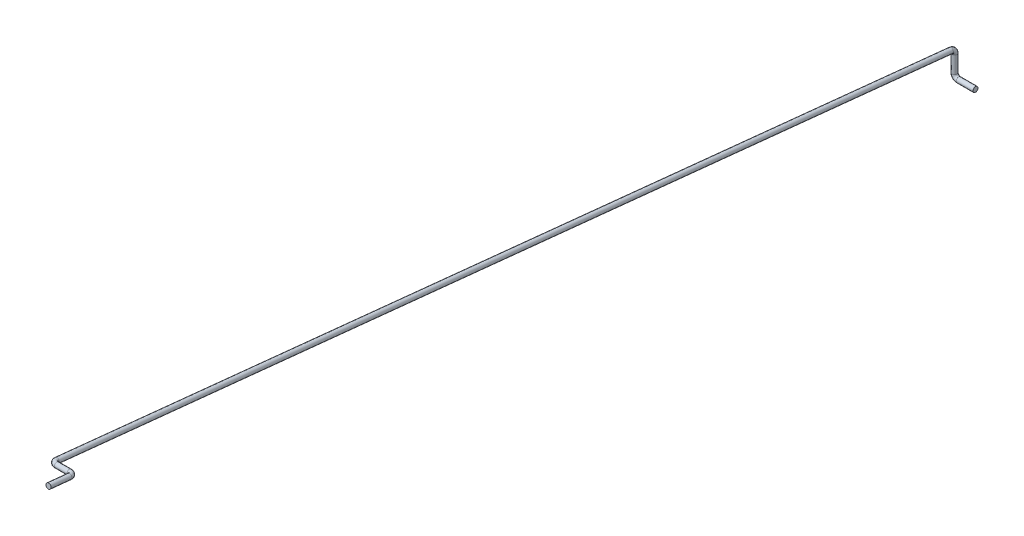
ISO-10303-21;
HEADER;
FILE_DESCRIPTION(('STEP AP214'),'2;1');
FILE_NAME('part.step','',(''),(''),'','','');
FILE_SCHEMA(('AUTOMOTIVE_DESIGN { 1 0 10303 214 1 1 1 1 }'));
ENDSEC;
DATA;
#1=APPLICATION_CONTEXT('core data for automotive mechanical design processes');
#2=APPLICATION_PROTOCOL_DEFINITION('international standard','automotive_design',2000,#1);
#3=PRODUCT_CONTEXT('',#1,'mechanical');
#4=PRODUCT('Part','Part','',(#3));
#5=PRODUCT_RELATED_PRODUCT_CATEGORY('part','',(#4));
#6=PRODUCT_DEFINITION_FORMATION('','',#4);
#7=PRODUCT_DEFINITION_CONTEXT('part definition',#1,'design');
#8=PRODUCT_DEFINITION('design','',#6,#7);
#9=PRODUCT_DEFINITION_SHAPE('','',#8);
#10=(LENGTH_UNIT() NAMED_UNIT(*) SI_UNIT(.MILLI.,.METRE.));
#11=(NAMED_UNIT(*) PLANE_ANGLE_UNIT() SI_UNIT($,.RADIAN.));
#12=(NAMED_UNIT(*) SI_UNIT($,.STERADIAN.) SOLID_ANGLE_UNIT());
#13=UNCERTAINTY_MEASURE_WITH_UNIT(LENGTH_MEASURE(1.E-05),#10,'distance_accuracy_value','');
#14=(GEOMETRIC_REPRESENTATION_CONTEXT(3) GLOBAL_UNCERTAINTY_ASSIGNED_CONTEXT((#13)) GLOBAL_UNIT_ASSIGNED_CONTEXT((#10,
#11,#12)) REPRESENTATION_CONTEXT('',''));
#15=CARTESIAN_POINT('',(0.,0.,0.));
#16=DIRECTION('',(0.,0.,1.));
#17=DIRECTION('',(1.,0.,0.));
#18=AXIS2_PLACEMENT_3D('',#15,#16,#17);
#19=CARTESIAN_POINT('',(0.,2.99475970675467,0.897759470769358));
#20=DIRECTION('',(0.,0.102240529230642,0.994759706754671));
#21=DIRECTION('',(0.,-0.994759706754671,0.102240529230642));
#22=AXIS2_PLACEMENT_3D('',#19,#20,#21);
#23=CYLINDRICAL_SURFACE('',#22,0.6);
#24=CARTESIAN_POINT('',(0.,2.99475970675467,0.897759470769358));
#25=DIRECTION('',(0.,0.102240529230644,0.99475970675467));
#26=DIRECTION('',(0.,-0.99475970675467,0.102240529230644));
#27=AXIS2_PLACEMENT_3D('',#24,#25,#26);
#28=CIRCLE('',#27,0.6);
#29=CARTESIAN_POINT('',(0.,3.59161553080747,0.836415153230973));
#30=VERTEX_POINT('',#29);
#31=EDGE_CURVE('E35',#30,#30,#28,.T.);
#32=ORIENTED_EDGE('',*,*,#31,.T.);
#33=EDGE_LOOP('',(#32));
#34=FACE_BOUND('',#33,.T.);
#35=CARTESIAN_POINT('',(0.,24.8977594707693,214.005240293245));
#36=DIRECTION('',(0.,0.102240529230644,0.99475970675467));
#37=DIRECTION('',(0.,-0.99475970675467,0.102240529230644));
#38=AXIS2_PLACEMENT_3D('',#35,#36,#37);
#39=CIRCLE('',#38,0.6);
#40=CARTESIAN_POINT('',(-0.599999999999984,24.8977594707693,214.005240293245));
#41=VERTEX_POINT('',#40);
#42=EDGE_CURVE('E10',#41,#41,#39,.T.);
#43=ORIENTED_EDGE('',*,*,#42,.F.);
#44=EDGE_LOOP('',(#43));
#45=FACE_BOUND('',#44,.T.);
#46=ADVANCED_FACE('F29',(#34,#45),#23,.T.);
#47=CARTESIAN_POINT('',(0.,2.,1.));
#48=DIRECTION('',(1.,0.,0.));
#49=DIRECTION('',(0.,0.,-1.));
#50=AXIS2_PLACEMENT_3D('',#47,#48,#49);
#51=TOROIDAL_SURFACE('',#50,1.,0.6);
#52=CARTESIAN_POINT('',(0.,2.,0.));
#53=DIRECTION('',(0.,1.,0.));
#54=DIRECTION('',(0.,0.,1.));
#55=AXIS2_PLACEMENT_3D('',#52,#53,#54);
#56=CIRCLE('',#55,0.6);
#57=CARTESIAN_POINT('',(0.,2.,-0.6));
#58=VERTEX_POINT('',#57);
#59=EDGE_CURVE('E39',#58,#58,#56,.T.);
#60=CARTESIAN_POINT('',(0.,2.,1.));
#61=DIRECTION('',(1.,0.,0.));
#62=DIRECTION('',(0.,0.,-1.));
#63=AXIS2_PLACEMENT_3D('',#60,#61,#62);
#64=CIRCLE('',#63,1.6);
#65=EDGE_CURVE('',#58,#30,#64,.T.);
#66=ORIENTED_EDGE('',*,*,#59,.T.);
#67=ORIENTED_EDGE('',*,*,#31,.F.);
#68=ORIENTED_EDGE('',*,*,#65,.T.);
#69=ORIENTED_EDGE('',*,*,#65,.F.);
#70=EDGE_LOOP('',(#66,#68,#67,#69));
#71=FACE_BOUND('',#70,.T.);
#72=ADVANCED_FACE('F83',(#71),#51,.T.);
#73=CARTESIAN_POINT('',(0.,2.,0.));
#74=DIRECTION('',(0.,-1.,0.));
#75=DIRECTION('',(0.,0.,-1.));
#76=AXIS2_PLACEMENT_3D('',#73,#74,#75);
#77=CYLINDRICAL_SURFACE('',#76,0.6);
#78=ORIENTED_EDGE('',*,*,#59,.F.);
#79=EDGE_LOOP('',(#78));
#80=FACE_BOUND('',#79,.T.);
#81=CARTESIAN_POINT('',(0.,-2.,0.));
#82=DIRECTION('',(0.,-1.,0.));
#83=DIRECTION('',(0.,0.,-1.));
#84=AXIS2_PLACEMENT_3D('',#81,#82,#83);
#85=CIRCLE('',#84,0.6);
#86=CARTESIAN_POINT('',(-0.6,-2.,0.));
#87=VERTEX_POINT('',#86);
#88=EDGE_CURVE('E51',#87,#87,#85,.T.);
#89=ORIENTED_EDGE('',*,*,#88,.F.);
#90=EDGE_LOOP('',(#89));
#91=FACE_BOUND('',#90,.T.);
#92=ADVANCED_FACE('F87',(#80,#91),#77,.T.);
#93=CARTESIAN_POINT('',(1.,-3.,0.));
#94=DIRECTION('',(1.,0.,0.));
#95=DIRECTION('',(0.,0.,-1.));
#96=AXIS2_PLACEMENT_3D('',#93,#94,#95);
#97=CYLINDRICAL_SURFACE('',#96,0.6);
#98=CARTESIAN_POINT('',(1.,-3.,0.));
#99=DIRECTION('',(1.,0.,0.));
#100=DIRECTION('',(0.,0.,-1.));
#101=AXIS2_PLACEMENT_3D('',#98,#99,#100);
#102=CIRCLE('',#101,0.6);
#103=CARTESIAN_POINT('',(1.,-3.6,0.));
#104=VERTEX_POINT('',#103);
#105=EDGE_CURVE('E48',#104,#104,#102,.T.);
#106=ORIENTED_EDGE('',*,*,#105,.T.);
#107=EDGE_LOOP('',(#106));
#108=FACE_BOUND('',#107,.T.);
#109=CARTESIAN_POINT('',(5.,-3.,0.));
#110=DIRECTION('',(1.,0.,0.));
#111=DIRECTION('',(0.,0.,-1.));
#112=AXIS2_PLACEMENT_3D('',#109,#110,#111);
#113=CIRCLE('',#112,0.6);
#114=CARTESIAN_POINT('',(5.,-3.,-0.6));
#115=VERTEX_POINT('',#114);
#116=EDGE_CURVE('E43',#115,#115,#113,.T.);
#117=ORIENTED_EDGE('',*,*,#116,.F.);
#118=EDGE_LOOP('',(#117));
#119=FACE_BOUND('',#118,.T.);
#120=ADVANCED_FACE('F93',(#108,#119),#97,.T.);
#121=CARTESIAN_POINT('',(1.,-2.,0.));
#122=DIRECTION('',(0.,0.,1.));
#123=DIRECTION('',(1.,0.,0.));
#124=AXIS2_PLACEMENT_3D('',#121,#122,#123);
#125=TOROIDAL_SURFACE('',#124,1.,0.6);
#126=CARTESIAN_POINT('',(1.,-2.,0.));
#127=DIRECTION('',(0.,0.,1.));
#128=DIRECTION('',(1.,0.,0.));
#129=AXIS2_PLACEMENT_3D('',#126,#127,#128);
#130=CIRCLE('',#129,1.6);
#131=EDGE_CURVE('',#87,#104,#130,.T.);
#132=ORIENTED_EDGE('',*,*,#88,.T.);
#133=ORIENTED_EDGE('',*,*,#105,.F.);
#134=ORIENTED_EDGE('',*,*,#131,.T.);
#135=ORIENTED_EDGE('',*,*,#131,.F.);
#136=EDGE_LOOP('',(#132,#134,#133,#135));
#137=FACE_BOUND('',#136,.T.);
#138=ADVANCED_FACE('F100',(#137),#125,.T.);
#139=CARTESIAN_POINT('',(5.,-3.,0.));
#140=DIRECTION('',(1.,0.,0.));
#141=DIRECTION('',(0.,0.,-1.));
#142=AXIS2_PLACEMENT_3D('',#139,#140,#141);
#143=PLANE('',#142);
#144=ORIENTED_EDGE('',*,*,#116,.T.);
#145=EDGE_LOOP('',(#144));
#146=FACE_BOUND('',#145,.T.);
#147=ADVANCED_FACE('F104',(#146),#143,.T.);
#148=CARTESIAN_POINT('',(5.,25.1022405292306,215.994759706755));
#149=DIRECTION('',(0.,0.102240529230642,0.994759706754671));
#150=DIRECTION('',(0.,-0.994759706754671,0.102240529230642));
#151=AXIS2_PLACEMENT_3D('',#148,#149,#150);
#152=CYLINDRICAL_SURFACE('',#151,0.599999999999996);
#153=CARTESIAN_POINT('',(5.,25.1022405292306,215.994759706755));
#154=DIRECTION('',(0.,0.102240529230644,0.99475970675467));
#155=DIRECTION('',(0.,-0.994759706754671,0.102240529230644));
#156=AXIS2_PLACEMENT_3D('',#153,#154,#155);
#157=CIRCLE('',#156,0.599999999999996);
#158=CARTESIAN_POINT('',(5.6,25.1022405292306,215.994759706755));
#159=VERTEX_POINT('',#158);
#160=EDGE_CURVE('E57',#159,#159,#157,.T.);
#161=ORIENTED_EDGE('',*,*,#160,.T.);
#162=EDGE_LOOP('',(#161));
#163=FACE_BOUND('',#162,.T.);
#164=CARTESIAN_POINT('',(5.00000000000001,25.6134431753838,220.968558240528));
#165=DIRECTION('',(0.,0.102240529230644,0.99475970675467));
#166=DIRECTION('',(0.,-0.994759706754671,0.102240529230644));
#167=AXIS2_PLACEMENT_3D('',#164,#165,#166);
#168=CIRCLE('',#167,0.599999999999996);
#169=CARTESIAN_POINT('',(5.00000000000001,25.016587351331,221.029902558066));
#170=VERTEX_POINT('',#169);
#171=EDGE_CURVE('E54',#170,#170,#168,.T.);
#172=ORIENTED_EDGE('',*,*,#171,.F.);
#173=EDGE_LOOP('',(#172));
#174=FACE_BOUND('',#173,.T.);
#175=ADVANCED_FACE('F108',(#163,#174),#152,.T.);
#176=CARTESIAN_POINT('',(4.00000000000001,25.1022405292306,215.994759706755));
#177=DIRECTION('',(0.,-0.994759706754671,0.102240529230642));
#178=DIRECTION('',(0.,-0.102240529230642,-0.994759706754671));
#179=AXIS2_PLACEMENT_3D('',#176,#177,#178);
#180=TOROIDAL_SURFACE('',#179,0.999999999999996,0.599999999999996);
#181=CARTESIAN_POINT('',(4.,25.,215.));
#182=DIRECTION('',(1.,0.,0.));
#183=DIRECTION('',(0.,-0.994759706754671,0.102240529230642));
#184=AXIS2_PLACEMENT_3D('',#181,#182,#183);
#185=CIRCLE('',#184,0.599999999999996);
#186=CARTESIAN_POINT('',(4.,24.9386556824616,214.403144175947));
#187=VERTEX_POINT('',#186);
#188=EDGE_CURVE('E60',#187,#187,#185,.T.);
#189=CARTESIAN_POINT('',(4.00000000000001,25.1022405292306,215.994759706755));
#190=DIRECTION('',(0.,-0.994759706754671,0.102240529230642));
#191=DIRECTION('',(0.,-0.102240529230642,-0.994759706754671));
#192=AXIS2_PLACEMENT_3D('',#189,#190,#191);
#193=CIRCLE('',#192,1.59999999999999);
#194=EDGE_CURVE('',#187,#159,#193,.T.);
#195=ORIENTED_EDGE('',*,*,#188,.T.);
#196=ORIENTED_EDGE('',*,*,#160,.F.);
#197=ORIENTED_EDGE('',*,*,#194,.T.);
#198=ORIENTED_EDGE('',*,*,#194,.F.);
#199=EDGE_LOOP('',(#195,#197,#196,#198));
#200=FACE_BOUND('',#199,.T.);
#201=ADVANCED_FACE('F80',(#200),#180,.T.);
#202=CARTESIAN_POINT('',(1.,25.,215.));
#203=DIRECTION('',(1.,0.,0.));
#204=DIRECTION('',(0.,0.,-1.));
#205=AXIS2_PLACEMENT_3D('',#202,#203,#204);
#206=CYLINDRICAL_SURFACE('',#205,0.599999999999996);
#207=CARTESIAN_POINT('',(1.,25.,215.));
#208=DIRECTION('',(1.,0.,0.));
#209=DIRECTION('',(0.,-0.994759706754671,0.102240529230642));
#210=AXIS2_PLACEMENT_3D('',#207,#208,#209);
#211=CIRCLE('',#210,0.599999999999996);
#212=CARTESIAN_POINT('',(0.999999999999997,25.0613443175383,215.596855824053));
#213=VERTEX_POINT('',#212);
#214=EDGE_CURVE('E63',#213,#213,#211,.T.);
#215=ORIENTED_EDGE('',*,*,#214,.T.);
#216=EDGE_LOOP('',(#215));
#217=FACE_BOUND('',#216,.T.);
#218=ORIENTED_EDGE('',*,*,#188,.F.);
#219=EDGE_LOOP('',(#218));
#220=FACE_BOUND('',#219,.T.);
#221=ADVANCED_FACE('F67',(#217,#220),#206,.T.);
#222=CARTESIAN_POINT('',(1.00000000000001,24.8977594707693,214.005240293245));
#223=DIRECTION('',(0.,-0.994759706754671,0.102240529230642));
#224=DIRECTION('',(0.,-0.102240529230642,-0.994759706754671));
#225=AXIS2_PLACEMENT_3D('',#222,#223,#224);
#226=TOROIDAL_SURFACE('',#225,0.999999999999996,0.599999999999996);
#227=CARTESIAN_POINT('',(1.00000000000001,24.8977594707693,214.005240293245));
#228=DIRECTION('',(0.,-0.994759706754671,0.102240529230642));
#229=DIRECTION('',(0.,-0.102240529230642,-0.994759706754671));
#230=AXIS2_PLACEMENT_3D('',#227,#228,#229);
#231=CIRCLE('',#230,1.59999999999999);
#232=EDGE_CURVE('',#213,#41,#231,.T.);
#233=ORIENTED_EDGE('',*,*,#214,.F.);
#234=ORIENTED_EDGE('',*,*,#42,.T.);
#235=ORIENTED_EDGE('',*,*,#232,.T.);
#236=ORIENTED_EDGE('',*,*,#232,.F.);
#237=EDGE_LOOP('',(#233,#235,#234,#236));
#238=FACE_BOUND('',#237,.T.);
#239=ADVANCED_FACE('F70',(#238),#226,.T.);
#240=CARTESIAN_POINT('',(5.00000000000001,25.6134431753838,220.968558240528));
#241=DIRECTION('',(0.,0.102240529230644,0.99475970675467));
#242=DIRECTION('',(0.,-0.994759706754671,0.102240529230644));
#243=AXIS2_PLACEMENT_3D('',#240,#241,#242);
#244=PLANE('',#243);
#245=ORIENTED_EDGE('',*,*,#171,.T.);
#246=EDGE_LOOP('',(#245));
#247=FACE_BOUND('',#246,.T.);
#248=ADVANCED_FACE('F72',(#247),#244,.T.);
#249=CLOSED_SHELL('',(#46,#72,#92,#120,#138,#147,#175,#201,#221,#239,#248));
#250=MANIFOLD_SOLID_BREP('B2',#249);
#251=ADVANCED_BREP_SHAPE_REPRESENTATION('',(#18,#250),#14);
#252=SHAPE_DEFINITION_REPRESENTATION(#9,#251);
ENDSEC;
END-ISO-10303-21;
